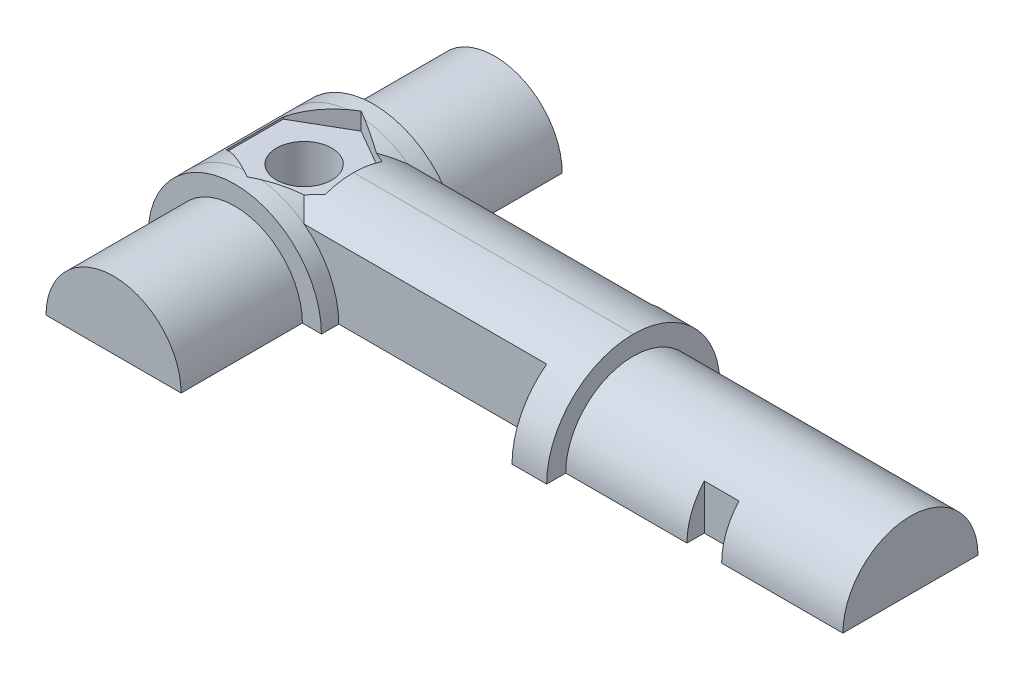
ISO-10303-21;
HEADER;
FILE_DESCRIPTION(('STEP AP214'),'2;1');
FILE_NAME('part.step','',(''),(''),'','','');
FILE_SCHEMA(('AUTOMOTIVE_DESIGN { 1 0 10303 214 1 1 1 1 }'));
ENDSEC;
DATA;
#1=APPLICATION_CONTEXT('core data for automotive mechanical design processes');
#2=APPLICATION_PROTOCOL_DEFINITION('international standard','automotive_design',2000,#1);
#3=PRODUCT_CONTEXT('',#1,'mechanical');
#4=PRODUCT('Part','Part','',(#3));
#5=PRODUCT_RELATED_PRODUCT_CATEGORY('part','',(#4));
#6=PRODUCT_DEFINITION_FORMATION('','',#4);
#7=PRODUCT_DEFINITION_CONTEXT('part definition',#1,'design');
#8=PRODUCT_DEFINITION('design','',#6,#7);
#9=PRODUCT_DEFINITION_SHAPE('','',#8);
#10=(LENGTH_UNIT() NAMED_UNIT(*) SI_UNIT(.MILLI.,.METRE.));
#11=(NAMED_UNIT(*) PLANE_ANGLE_UNIT() SI_UNIT($,.RADIAN.));
#12=(NAMED_UNIT(*) SI_UNIT($,.STERADIAN.) SOLID_ANGLE_UNIT());
#13=UNCERTAINTY_MEASURE_WITH_UNIT(LENGTH_MEASURE(1.E-05),#10,'distance_accuracy_value','');
#14=(GEOMETRIC_REPRESENTATION_CONTEXT(3) GLOBAL_UNCERTAINTY_ASSIGNED_CONTEXT((#13)) GLOBAL_UNIT_ASSIGNED_CONTEXT((#10,
#11,#12)) REPRESENTATION_CONTEXT('',''));
#15=CARTESIAN_POINT('',(0.,0.,0.));
#16=DIRECTION('',(0.,0.,1.));
#17=DIRECTION('',(1.,0.,0.));
#18=AXIS2_PLACEMENT_3D('',#15,#16,#17);
#19=CARTESIAN_POINT('',(0.,0.,4.));
#20=DIRECTION('',(0.,0.,-1.));
#21=DIRECTION('',(-1.,0.,0.));
#22=AXIS2_PLACEMENT_3D('',#19,#20,#21);
#23=CYLINDRICAL_SURFACE('',#22,5.);
#24=CARTESIAN_POINT('',(0.,0.,3.29089653438087));
#25=DIRECTION('',(-0.5,0.,-0.866025403784439));
#26=DIRECTION('',(0.866025403784439,0.,-0.5));
#27=AXIS2_PLACEMENT_3D('',#24,#25,#26);
#28=ELLIPSE('',#27,5.77350269189626,5.);
#29=CARTESIAN_POINT('',(0.,5.,3.29089653438087));
#30=VERTEX_POINT('',#29);
#31=CARTESIAN_POINT('',(0.503847577293437,4.97454898647663,3.));
#32=VERTEX_POINT('',#31);
#33=EDGE_CURVE('E283',#30,#32,#28,.T.);
#34=ORIENTED_EDGE('',*,*,#33,.F.);
#35=CARTESIAN_POINT('',(0.,0.,3.29089653438087));
#36=DIRECTION('',(0.5,0.,-0.866025403784438));
#37=DIRECTION('',(-0.866025403784438,0.,-0.5));
#38=AXIS2_PLACEMENT_3D('',#35,#36,#37);
#39=ELLIPSE('',#38,5.77350269189626,5.);
#40=CARTESIAN_POINT('',(-0.503847577293381,4.97454898647663,3.));
#41=VERTEX_POINT('',#40);
#42=EDGE_CURVE('E288',#41,#30,#39,.T.);
#43=ORIENTED_EDGE('',*,*,#42,.F.);
#44=CARTESIAN_POINT('',(0.,0.,3.));
#45=DIRECTION('',(0.,0.,1.));
#46=DIRECTION('',(-1.,0.,0.));
#47=AXIS2_PLACEMENT_3D('',#44,#45,#46);
#48=CIRCLE('',#47,5.);
#49=CARTESIAN_POINT('',(-5.00000000000006,0.,3.));
#50=VERTEX_POINT('',#49);
#51=EDGE_CURVE('E411',#41,#50,#48,.T.);
#52=ORIENTED_EDGE('',*,*,#51,.T.);
#53=DIRECTION('',(0.,0.,-1.));
#54=VECTOR('',#53,1.);
#55=CARTESIAN_POINT('',(-5.00000000000006,0.,4.));
#56=LINE('',#55,#54);
#57=CARTESIAN_POINT('',(-5.00000000000006,0.,4.));
#58=VERTEX_POINT('',#57);
#59=EDGE_CURVE('E415',#58,#50,#56,.T.);
#60=ORIENTED_EDGE('',*,*,#59,.F.);
#61=CARTESIAN_POINT('',(0.,0.,4.));
#62=DIRECTION('',(0.,0.,1.));
#63=DIRECTION('',(-1.,0.,0.));
#64=AXIS2_PLACEMENT_3D('',#61,#62,#63);
#65=CIRCLE('',#64,5.);
#66=CARTESIAN_POINT('',(5.00000000000006,0.,4.));
#67=VERTEX_POINT('',#66);
#68=EDGE_CURVE('E402',#67,#58,#65,.T.);
#69=ORIENTED_EDGE('',*,*,#68,.F.);
#70=DIRECTION('',(0.,0.,-1.));
#71=VECTOR('',#70,1.);
#72=CARTESIAN_POINT('',(5.00000000000006,0.,4.));
#73=LINE('',#72,#71);
#74=CARTESIAN_POINT('',(5.00000000000006,0.,3.));
#75=VERTEX_POINT('',#74);
#76=EDGE_CURVE('E408',#67,#75,#73,.T.);
#77=ORIENTED_EDGE('',*,*,#76,.T.);
#78=CARTESIAN_POINT('',(3.00000000000006,4.,3.));
#79=VERTEX_POINT('',#78);
#80=EDGE_CURVE('E401',#75,#79,#48,.T.);
#81=ORIENTED_EDGE('',*,*,#80,.T.);
#82=EDGE_CURVE('E412',#79,#32,#48,.T.);
#83=ORIENTED_EDGE('',*,*,#82,.T.);
#84=EDGE_LOOP('',(#34,#43,#52,#60,#69,#77,#81,#83));
#85=FACE_BOUND('',#84,.T.);
#86=ADVANCED_FACE('F38',(#85),#23,.T.);
#87=CARTESIAN_POINT('',(0.,0.,-4.));
#88=DIRECTION('',(0.,0.,1.));
#89=DIRECTION('',(1.,0.,0.));
#90=AXIS2_PLACEMENT_3D('',#87,#88,#89);
#91=CYLINDRICAL_SURFACE('',#90,5.);
#92=CARTESIAN_POINT('',(0.,0.,-3.29089653438087));
#93=DIRECTION('',(0.5,0.,0.866025403784438));
#94=DIRECTION('',(-0.866025403784439,0.,0.5));
#95=AXIS2_PLACEMENT_3D('',#92,#93,#94);
#96=ELLIPSE('',#95,5.77350269189626,5.);
#97=CARTESIAN_POINT('',(-0.503847577293381,4.97454898647663,-3.));
#98=VERTEX_POINT('',#97);
#99=CARTESIAN_POINT('',(0.,5.,-3.29089653438087));
#100=VERTEX_POINT('',#99);
#101=EDGE_CURVE('E285',#98,#100,#96,.F.);
#102=ORIENTED_EDGE('',*,*,#101,.T.);
#103=CARTESIAN_POINT('',(0.,0.,-3.29089653438087));
#104=DIRECTION('',(-0.5,0.,0.866025403784438));
#105=DIRECTION('',(0.866025403784438,0.,0.5));
#106=AXIS2_PLACEMENT_3D('',#103,#104,#105);
#107=ELLIPSE('',#106,5.77350269189626,5.);
#108=CARTESIAN_POINT('',(0.50384757729327,4.97454898647663,-3.));
#109=VERTEX_POINT('',#108);
#110=EDGE_CURVE('E277',#100,#109,#107,.F.);
#111=ORIENTED_EDGE('',*,*,#110,.T.);
#112=CARTESIAN_POINT('',(0.,0.,-3.));
#113=DIRECTION('',(0.,0.,1.));
#114=DIRECTION('',(-1.,0.,0.));
#115=AXIS2_PLACEMENT_3D('',#112,#113,#114);
#116=CIRCLE('',#115,5.);
#117=CARTESIAN_POINT('',(3.00000000000006,4.,-3.));
#118=VERTEX_POINT('',#117);
#119=EDGE_CURVE('E381',#118,#109,#116,.T.);
#120=ORIENTED_EDGE('',*,*,#119,.F.);
#121=CARTESIAN_POINT('',(5.00000000000006,0.,-3.));
#122=VERTEX_POINT('',#121);
#123=EDGE_CURVE('E369',#122,#118,#116,.T.);
#124=ORIENTED_EDGE('',*,*,#123,.F.);
#125=DIRECTION('',(0.,0.,1.));
#126=VECTOR('',#125,1.);
#127=CARTESIAN_POINT('',(5.00000000000006,0.,-4.));
#128=LINE('',#127,#126);
#129=CARTESIAN_POINT('',(5.00000000000006,0.,-4.));
#130=VERTEX_POINT('',#129);
#131=EDGE_CURVE('E384',#130,#122,#128,.T.);
#132=ORIENTED_EDGE('',*,*,#131,.F.);
#133=CARTESIAN_POINT('',(0.,0.,-4.));
#134=DIRECTION('',(0.,0.,1.));
#135=DIRECTION('',(-1.,0.,0.));
#136=AXIS2_PLACEMENT_3D('',#133,#134,#135);
#137=CIRCLE('',#136,5.);
#138=CARTESIAN_POINT('',(-5.00000000000006,0.,-4.));
#139=VERTEX_POINT('',#138);
#140=EDGE_CURVE('E370',#130,#139,#137,.T.);
#141=ORIENTED_EDGE('',*,*,#140,.T.);
#142=DIRECTION('',(0.,0.,1.));
#143=VECTOR('',#142,1.);
#144=CARTESIAN_POINT('',(-5.00000000000006,0.,-4.));
#145=LINE('',#144,#143);
#146=CARTESIAN_POINT('',(-5.00000000000006,0.,-3.));
#147=VERTEX_POINT('',#146);
#148=EDGE_CURVE('E377',#139,#147,#145,.T.);
#149=ORIENTED_EDGE('',*,*,#148,.T.);
#150=EDGE_CURVE('E380',#98,#147,#116,.T.);
#151=ORIENTED_EDGE('',*,*,#150,.F.);
#152=EDGE_LOOP('',(#102,#111,#120,#124,#132,#141,#149,#151));
#153=FACE_BOUND('',#152,.T.);
#154=ADVANCED_FACE('F502',(#153),#91,.T.);
#155=CARTESIAN_POINT('',(0.,0.,0.));
#156=DIRECTION('',(0.,0.,-1.));
#157=DIRECTION('',(-1.,0.,0.));
#158=AXIS2_PLACEMENT_3D('',#155,#156,#157);
#159=CYLINDRICAL_SURFACE('',#158,5.);
#160=ORIENTED_EDGE('',*,*,#119,.T.);
#161=CARTESIAN_POINT('',(0.,0.,-3.29089653438087));
#162=DIRECTION('',(-0.5,0.,0.866025403784438));
#163=DIRECTION('',(-0.866025403784438,0.,-0.5));
#164=AXIS2_PLACEMENT_3D('',#161,#162,#163);
#165=ELLIPSE('',#164,5.77350269189626,5.);
#166=CARTESIAN_POINT('',(2.08634480157127,4.54391520265909,-2.0863448015713));
#167=VERTEX_POINT('',#166);
#168=EDGE_CURVE('E274',#109,#167,#165,.F.);
#169=ORIENTED_EDGE('',*,*,#168,.T.);
#170=CARTESIAN_POINT('',(0.,0.,0.));
#171=DIRECTION('',(0.707106781186547,0.,0.707106781186547));
#172=DIRECTION('',(0.707106781186547,0.,-0.707106781186547));
#173=AXIS2_PLACEMENT_3D('',#170,#171,#172);
#174=ELLIPSE('',#173,7.07106781186547,5.);
#175=EDGE_CURVE('E435',#167,#118,#174,.F.);
#176=ORIENTED_EDGE('',*,*,#175,.T.);
#177=EDGE_LOOP('',(#160,#169,#176));
#178=FACE_BOUND('',#177,.T.);
#179=ADVANCED_FACE('F579',(#178),#159,.T.);
#180=CARTESIAN_POINT('',(0.,0.,0.));
#181=DIRECTION('',(0.707106781186547,0.,-0.707106781186547));
#182=DIRECTION('',(0.707106781186547,0.,0.707106781186547));
#183=AXIS2_PLACEMENT_3D('',#180,#181,#182);
#184=ELLIPSE('',#183,7.07106781186547,5.);
#185=CARTESIAN_POINT('',(2.08634480157133,4.54391520265909,2.0863448015713));
#186=VERTEX_POINT('',#185);
#187=EDGE_CURVE('E437',#79,#186,#184,.F.);
#188=ORIENTED_EDGE('',*,*,#187,.T.);
#189=CARTESIAN_POINT('',(0.,0.,3.29089653438087));
#190=DIRECTION('',(-0.5,0.,-0.866025403784439));
#191=DIRECTION('',(0.866025403784439,0.,-0.5));
#192=AXIS2_PLACEMENT_3D('',#189,#190,#191);
#193=ELLIPSE('',#192,5.77350269189626,5.);
#194=EDGE_CURVE('E280',#186,#32,#193,.F.);
#195=ORIENTED_EDGE('',*,*,#194,.T.);
#196=ORIENTED_EDGE('',*,*,#82,.F.);
#197=EDGE_LOOP('',(#188,#195,#196));
#198=FACE_BOUND('',#197,.T.);
#199=ADVANCED_FACE('F529',(#198),#159,.T.);
#200=ORIENTED_EDGE('',*,*,#51,.F.);
#201=CARTESIAN_POINT('',(0.,0.,3.29089653438087));
#202=DIRECTION('',(0.5,0.,-0.866025403784438));
#203=DIRECTION('',(-0.866025403784438,0.,-0.5));
#204=AXIS2_PLACEMENT_3D('',#201,#202,#203);
#205=ELLIPSE('',#204,5.77350269189626,5.);
#206=CARTESIAN_POINT('',(-2.84999999999996,4.1082234603293,1.64544826719043));
#207=VERTEX_POINT('',#206);
#208=EDGE_CURVE('E11',#41,#207,#205,.F.);
#209=ORIENTED_EDGE('',*,*,#208,.T.);
#210=DIRECTION('',(0.,0.,-1.));
#211=VECTOR('',#210,1.);
#212=CARTESIAN_POINT('',(-2.85000000000002,4.1082234603293,0.));
#213=LINE('',#212,#211);
#214=CARTESIAN_POINT('',(-2.85000000000002,4.10822346032929,-1.64544826719043));
#215=VERTEX_POINT('',#214);
#216=EDGE_CURVE('E46',#207,#215,#213,.T.);
#217=ORIENTED_EDGE('',*,*,#216,.T.);
#218=CARTESIAN_POINT('',(0.,0.,-3.29089653438087));
#219=DIRECTION('',(0.5,0.,0.866025403784438));
#220=DIRECTION('',(0.866025403784439,0.,-0.5));
#221=AXIS2_PLACEMENT_3D('',#218,#219,#220);
#222=ELLIPSE('',#221,5.77350269189626,5.);
#223=EDGE_CURVE('E465',#215,#98,#222,.F.);
#224=ORIENTED_EDGE('',*,*,#223,.T.);
#225=ORIENTED_EDGE('',*,*,#150,.T.);
#226=DIRECTION('',(0.,0.,1.));
#227=VECTOR('',#226,1.);
#228=CARTESIAN_POINT('',(-5.00000000000006,0.,-3.));
#229=LINE('',#228,#227);
#230=EDGE_CURVE('E418',#147,#50,#229,.T.);
#231=ORIENTED_EDGE('',*,*,#230,.T.);
#232=EDGE_LOOP('',(#200,#209,#217,#224,#225,#231));
#233=FACE_BOUND('',#232,.T.);
#234=ADVANCED_FACE('F470',(#233),#159,.T.);
#235=CARTESIAN_POINT('',(19.,0.,0.));
#236=DIRECTION('',(1.,0.,0.));
#237=DIRECTION('',(0.,0.,-1.));
#238=AXIS2_PLACEMENT_3D('',#235,#236,#237);
#239=CYLINDRICAL_SURFACE('',#238,5.);
#240=DIRECTION('',(-1.,0.,0.));
#241=VECTOR('',#240,1.);
#242=CARTESIAN_POINT('',(19.,5.,0.));
#243=LINE('',#242,#241);
#244=CARTESIAN_POINT('',(2.85000000000002,5.,0.));
#245=VERTEX_POINT('',#244);
#246=CARTESIAN_POINT('',(19.,5.,0.));
#247=VERTEX_POINT('',#246);
#248=EDGE_CURVE('E331',#245,#247,#243,.F.);
#249=ORIENTED_EDGE('',*,*,#248,.F.);
#250=CARTESIAN_POINT('',(2.85000000000002,0.,0.));
#251=DIRECTION('',(-1.,0.,0.));
#252=DIRECTION('',(0.,0.,1.));
#253=AXIS2_PLACEMENT_3D('',#250,#251,#252);
#254=CIRCLE('',#253,5.);
#255=CARTESIAN_POINT('',(2.85000000000002,4.72149340781071,1.64544826719043));
#256=VERTEX_POINT('',#255);
#257=EDGE_CURVE('E53',#245,#256,#254,.F.);
#258=ORIENTED_EDGE('',*,*,#257,.T.);
#259=CARTESIAN_POINT('',(5.70000000000004,0.,0.));
#260=DIRECTION('',(-0.5,0.,-0.866025403784439));
#261=DIRECTION('',(0.866025403784439,0.,-0.5));
#262=AXIS2_PLACEMENT_3D('',#259,#260,#261);
#263=ELLIPSE('',#262,10.,5.);
#264=EDGE_CURVE('E462',#256,#186,#263,.F.);
#265=ORIENTED_EDGE('',*,*,#264,.T.);
#266=ORIENTED_EDGE('',*,*,#187,.F.);
#267=DIRECTION('',(1.,0.,0.));
#268=VECTOR('',#267,1.);
#269=CARTESIAN_POINT('',(17.,4.,3.));
#270=LINE('',#269,#268);
#271=CARTESIAN_POINT('',(17.,4.,3.));
#272=VERTEX_POINT('',#271);
#273=EDGE_CURVE('E432',#272,#79,#270,.F.);
#274=ORIENTED_EDGE('',*,*,#273,.F.);
#275=CARTESIAN_POINT('',(17.,0.,0.));
#276=DIRECTION('',(-1.,0.,0.));
#277=DIRECTION('',(0.,0.,1.));
#278=AXIS2_PLACEMENT_3D('',#275,#276,#277);
#279=CIRCLE('',#278,5.);
#280=CARTESIAN_POINT('',(17.,0.,5.));
#281=VERTEX_POINT('',#280);
#282=EDGE_CURVE('E430',#281,#272,#279,.T.);
#283=ORIENTED_EDGE('',*,*,#282,.F.);
#284=DIRECTION('',(-1.,0.,0.));
#285=VECTOR('',#284,1.);
#286=CARTESIAN_POINT('',(19.,0.,5.));
#287=LINE('',#286,#285);
#288=CARTESIAN_POINT('',(19.,0.,5.));
#289=VERTEX_POINT('',#288);
#290=EDGE_CURVE('E343',#289,#281,#287,.T.);
#291=ORIENTED_EDGE('',*,*,#290,.F.);
#292=CARTESIAN_POINT('',(19.,0.,0.));
#293=DIRECTION('',(-1.,0.,0.));
#294=DIRECTION('',(0.,0.,1.));
#295=AXIS2_PLACEMENT_3D('',#292,#293,#294);
#296=CIRCLE('',#295,5.);
#297=EDGE_CURVE('E425',#247,#289,#296,.F.);
#298=ORIENTED_EDGE('',*,*,#297,.F.);
#299=EDGE_LOOP('',(#249,#258,#265,#266,#274,#283,#291,#298));
#300=FACE_BOUND('',#299,.T.);
#301=ADVANCED_FACE('F40',(#300),#239,.T.);
#302=CARTESIAN_POINT('',(0.,0.,0.));
#303=DIRECTION('',(1.,0.,0.));
#304=DIRECTION('',(0.,0.,-1.));
#305=AXIS2_PLACEMENT_3D('',#302,#303,#304);
#306=CYLINDRICAL_SURFACE('',#305,5.);
#307=ORIENTED_EDGE('',*,*,#175,.F.);
#308=CARTESIAN_POINT('',(5.70000000000004,0.,0.));
#309=DIRECTION('',(-0.5,0.,0.866025403784438));
#310=DIRECTION('',(0.866025403784438,0.,0.5));
#311=AXIS2_PLACEMENT_3D('',#308,#309,#310);
#312=ELLIPSE('',#311,9.99999999999999,5.);
#313=CARTESIAN_POINT('',(2.85000000000002,4.72149340781071,-1.64544826719043));
#314=VERTEX_POINT('',#313);
#315=EDGE_CURVE('E460',#167,#314,#312,.F.);
#316=ORIENTED_EDGE('',*,*,#315,.T.);
#317=CARTESIAN_POINT('',(2.85000000000002,0.,0.));
#318=DIRECTION('',(-1.,0.,0.));
#319=DIRECTION('',(0.,0.,1.));
#320=AXIS2_PLACEMENT_3D('',#317,#318,#319);
#321=CIRCLE('',#320,5.);
#322=EDGE_CURVE('E263',#314,#245,#321,.F.);
#323=ORIENTED_EDGE('',*,*,#322,.T.);
#324=ORIENTED_EDGE('',*,*,#248,.T.);
#325=CARTESIAN_POINT('',(19.,0.,0.));
#326=DIRECTION('',(-1.,0.,0.));
#327=DIRECTION('',(0.,0.,1.));
#328=AXIS2_PLACEMENT_3D('',#325,#326,#327);
#329=CIRCLE('',#328,5.);
#330=CARTESIAN_POINT('',(19.,0.,-5.));
#331=VERTEX_POINT('',#330);
#332=EDGE_CURVE('E427',#331,#247,#329,.F.);
#333=ORIENTED_EDGE('',*,*,#332,.F.);
#334=DIRECTION('',(-1.,0.,0.));
#335=VECTOR('',#334,1.);
#336=CARTESIAN_POINT('',(19.,0.,-5.));
#337=LINE('',#336,#335);
#338=CARTESIAN_POINT('',(17.,0.,-5.));
#339=VERTEX_POINT('',#338);
#340=EDGE_CURVE('E335',#331,#339,#337,.T.);
#341=ORIENTED_EDGE('',*,*,#340,.T.);
#342=CARTESIAN_POINT('',(17.,0.,0.));
#343=DIRECTION('',(-1.,0.,0.));
#344=DIRECTION('',(0.,0.,1.));
#345=AXIS2_PLACEMENT_3D('',#342,#343,#344);
#346=CIRCLE('',#345,5.);
#347=CARTESIAN_POINT('',(17.,4.,-3.));
#348=VERTEX_POINT('',#347);
#349=EDGE_CURVE('E423',#348,#339,#346,.T.);
#350=ORIENTED_EDGE('',*,*,#349,.F.);
#351=DIRECTION('',(1.,0.,0.));
#352=VECTOR('',#351,1.);
#353=CARTESIAN_POINT('',(3.00000000000006,4.,-3.));
#354=LINE('',#353,#352);
#355=EDGE_CURVE('E421',#118,#348,#354,.T.);
#356=ORIENTED_EDGE('',*,*,#355,.F.);
#357=EDGE_LOOP('',(#307,#316,#323,#324,#333,#341,#350,#356));
#358=FACE_BOUND('',#357,.T.);
#359=ADVANCED_FACE('F534',(#358),#306,.T.);
#360=CARTESIAN_POINT('',(-5.,5.,-3.));
#361=DIRECTION('',(0.,0.,1.));
#362=DIRECTION('',(1.,0.,0.));
#363=AXIS2_PLACEMENT_3D('',#360,#361,#362);
#364=PLANE('',#363);
#365=ORIENTED_EDGE('',*,*,#123,.T.);
#366=ORIENTED_EDGE('',*,*,#355,.T.);
#367=DIRECTION('',(0.,1.,0.));
#368=VECTOR('',#367,1.);
#369=CARTESIAN_POINT('',(17.,5.,-3.));
#370=LINE('',#369,#368);
#371=CARTESIAN_POINT('',(17.,0.,-3.));
#372=VERTEX_POINT('',#371);
#373=EDGE_CURVE('E345',#372,#348,#370,.T.);
#374=ORIENTED_EDGE('',*,*,#373,.F.);
#375=DIRECTION('',(-1.,0.,0.));
#376=VECTOR('',#375,1.);
#377=CARTESIAN_POINT('',(17.,0.,-3.));
#378=LINE('',#377,#376);
#379=EDGE_CURVE('E350',#372,#122,#378,.T.);
#380=ORIENTED_EDGE('',*,*,#379,.T.);
#381=EDGE_LOOP('',(#365,#366,#374,#380));
#382=FACE_BOUND('',#381,.T.);
#383=ADVANCED_FACE('F551',(#382),#364,.F.);
#384=CARTESIAN_POINT('',(-5.00000000000006,5.,3.));
#385=DIRECTION('',(0.,0.,-1.));
#386=DIRECTION('',(-1.,0.,0.));
#387=AXIS2_PLACEMENT_3D('',#384,#385,#386);
#388=PLANE('',#387);
#389=DIRECTION('',(0.,-1.,0.));
#390=VECTOR('',#389,1.);
#391=CARTESIAN_POINT('',(17.,5.,3.));
#392=LINE('',#391,#390);
#393=CARTESIAN_POINT('',(17.,0.,3.));
#394=VERTEX_POINT('',#393);
#395=EDGE_CURVE('E348',#272,#394,#392,.T.);
#396=ORIENTED_EDGE('',*,*,#395,.F.);
#397=ORIENTED_EDGE('',*,*,#273,.T.);
#398=ORIENTED_EDGE('',*,*,#80,.F.);
#399=DIRECTION('',(-1.,0.,0.));
#400=VECTOR('',#399,1.);
#401=CARTESIAN_POINT('',(17.,0.,3.));
#402=LINE('',#401,#400);
#403=EDGE_CURVE('E353',#394,#75,#402,.T.);
#404=ORIENTED_EDGE('',*,*,#403,.F.);
#405=EDGE_LOOP('',(#396,#397,#398,#404));
#406=FACE_BOUND('',#405,.T.);
#407=ADVANCED_FACE('F522',(#406),#388,.F.);
#408=CARTESIAN_POINT('',(0.,0.,0.));
#409=DIRECTION('',(0.,1.,0.));
#410=DIRECTION('',(0.,0.,1.));
#411=AXIS2_PLACEMENT_3D('',#408,#409,#410);
#412=PLANE('',#411);
#413=CARTESIAN_POINT('',(0.,0.,0.));
#414=DIRECTION('',(0.,-1.,0.));
#415=DIRECTION('',(0.,0.,-1.));
#416=AXIS2_PLACEMENT_3D('',#413,#414,#415);
#417=CIRCLE('',#416,1.6);
#418=CARTESIAN_POINT('',(0.,0.,-1.6));
#419=VERTEX_POINT('',#418);
#420=EDGE_CURVE('E290',#419,#419,#417,.T.);
#421=ORIENTED_EDGE('',*,*,#420,.F.);
#422=EDGE_LOOP('',(#421));
#423=FACE_BOUND('',#422,.T.);
#424=DIRECTION('',(-1.,0.,0.));
#425=VECTOR('',#424,1.);
#426=CARTESIAN_POINT('',(35.,0.,3.9));
#427=LINE('',#426,#425);
#428=CARTESIAN_POINT('',(35.,0.,3.9));
#429=VERTEX_POINT('',#428);
#430=CARTESIAN_POINT('',(28.,0.,3.9));
#431=VERTEX_POINT('',#430);
#432=EDGE_CURVE('E328',#429,#431,#427,.T.);
#433=ORIENTED_EDGE('',*,*,#432,.T.);
#434=DIRECTION('',(0.,0.,1.));
#435=VECTOR('',#434,1.);
#436=CARTESIAN_POINT('',(28.,0.,2.9));
#437=LINE('',#436,#435);
#438=CARTESIAN_POINT('',(28.,0.,2.9));
#439=VERTEX_POINT('',#438);
#440=EDGE_CURVE('E291',#439,#431,#437,.T.);
#441=ORIENTED_EDGE('',*,*,#440,.F.);
#442=DIRECTION('',(1.,0.,0.));
#443=VECTOR('',#442,1.);
#444=CARTESIAN_POINT('',(26.,0.,2.9));
#445=LINE('',#444,#443);
#446=CARTESIAN_POINT('',(26.,0.,2.9));
#447=VERTEX_POINT('',#446);
#448=EDGE_CURVE('E296',#447,#439,#445,.T.);
#449=ORIENTED_EDGE('',*,*,#448,.F.);
#450=DIRECTION('',(0.,0.,-1.));
#451=VECTOR('',#450,1.);
#452=CARTESIAN_POINT('',(26.,0.,2.9));
#453=LINE('',#452,#451);
#454=CARTESIAN_POINT('',(26.,0.,3.9));
#455=VERTEX_POINT('',#454);
#456=EDGE_CURVE('E293',#455,#447,#453,.T.);
#457=ORIENTED_EDGE('',*,*,#456,.F.);
#458=CARTESIAN_POINT('',(19.0000000000001,0.,3.9));
#459=VERTEX_POINT('',#458);
#460=EDGE_CURVE('E327',#455,#459,#427,.T.);
#461=ORIENTED_EDGE('',*,*,#460,.T.);
#462=DIRECTION('',(0.,0.,-1.));
#463=VECTOR('',#462,1.);
#464=CARTESIAN_POINT('',(19.,0.,-5.));
#465=LINE('',#464,#463);
#466=EDGE_CURVE('E332',#289,#459,#465,.T.);
#467=ORIENTED_EDGE('',*,*,#466,.F.);
#468=ORIENTED_EDGE('',*,*,#290,.T.);
#469=DIRECTION('',(0.,0.,-1.));
#470=VECTOR('',#469,1.);
#471=CARTESIAN_POINT('',(17.,0.,-5.));
#472=LINE('',#471,#470);
#473=EDGE_CURVE('E337',#281,#394,#472,.T.);
#474=ORIENTED_EDGE('',*,*,#473,.T.);
#475=ORIENTED_EDGE('',*,*,#403,.T.);
#476=ORIENTED_EDGE('',*,*,#76,.F.);
#477=DIRECTION('',(1.,0.,0.));
#478=VECTOR('',#477,1.);
#479=CARTESIAN_POINT('',(5.00000000000006,0.,4.));
#480=LINE('',#479,#478);
#481=CARTESIAN_POINT('',(3.90000000000001,0.,4.));
#482=VERTEX_POINT('',#481);
#483=EDGE_CURVE('E405',#482,#67,#480,.T.);
#484=ORIENTED_EDGE('',*,*,#483,.F.);
#485=DIRECTION('',(0.,0.,-1.));
#486=VECTOR('',#485,1.);
#487=CARTESIAN_POINT('',(3.90000000000001,0.,11.));
#488=LINE('',#487,#486);
#489=CARTESIAN_POINT('',(3.90000000000001,0.,11.));
#490=VERTEX_POINT('',#489);
#491=EDGE_CURVE('E393',#490,#482,#488,.T.);
#492=ORIENTED_EDGE('',*,*,#491,.F.);
#493=DIRECTION('',(1.,0.,0.));
#494=VECTOR('',#493,1.);
#495=CARTESIAN_POINT('',(-3.89999999999996,0.,11.));
#496=LINE('',#495,#494);
#497=CARTESIAN_POINT('',(-3.89999999999996,0.,11.));
#498=VERTEX_POINT('',#497);
#499=EDGE_CURVE('E391',#498,#490,#496,.T.);
#500=ORIENTED_EDGE('',*,*,#499,.F.);
#501=DIRECTION('',(0.,0.,-1.));
#502=VECTOR('',#501,1.);
#503=CARTESIAN_POINT('',(-3.89999999999996,0.,11.));
#504=LINE('',#503,#502);
#505=CARTESIAN_POINT('',(-3.89999999999996,0.,4.));
#506=VERTEX_POINT('',#505);
#507=EDGE_CURVE('E398',#498,#506,#504,.T.);
#508=ORIENTED_EDGE('',*,*,#507,.T.);
#509=EDGE_CURVE('E406',#58,#506,#480,.T.);
#510=ORIENTED_EDGE('',*,*,#509,.F.);
#511=ORIENTED_EDGE('',*,*,#59,.T.);
#512=ORIENTED_EDGE('',*,*,#230,.F.);
#513=ORIENTED_EDGE('',*,*,#148,.F.);
#514=DIRECTION('',(1.,0.,0.));
#515=VECTOR('',#514,1.);
#516=CARTESIAN_POINT('',(5.00000000000006,0.,-4.));
#517=LINE('',#516,#515);
#518=CARTESIAN_POINT('',(-3.89999999999996,0.,-4.));
#519=VERTEX_POINT('',#518);
#520=EDGE_CURVE('E374',#139,#519,#517,.T.);
#521=ORIENTED_EDGE('',*,*,#520,.T.);
#522=DIRECTION('',(0.,0.,1.));
#523=VECTOR('',#522,1.);
#524=CARTESIAN_POINT('',(-3.90000000000001,0.,-11.));
#525=LINE('',#524,#523);
#526=CARTESIAN_POINT('',(-3.90000000000001,0.,-11.));
#527=VERTEX_POINT('',#526);
#528=EDGE_CURVE('E363',#527,#519,#525,.T.);
#529=ORIENTED_EDGE('',*,*,#528,.F.);
#530=DIRECTION('',(1.,0.,0.));
#531=VECTOR('',#530,1.);
#532=CARTESIAN_POINT('',(-3.90000000000001,0.,-11.));
#533=LINE('',#532,#531);
#534=CARTESIAN_POINT('',(3.90000000000001,0.,-11.));
#535=VERTEX_POINT('',#534);
#536=EDGE_CURVE('E360',#527,#535,#533,.T.);
#537=ORIENTED_EDGE('',*,*,#536,.T.);
#538=DIRECTION('',(0.,0.,1.));
#539=VECTOR('',#538,1.);
#540=CARTESIAN_POINT('',(3.90000000000001,0.,-11.));
#541=LINE('',#540,#539);
#542=CARTESIAN_POINT('',(3.90000000000007,0.,-4.));
#543=VERTEX_POINT('',#542);
#544=EDGE_CURVE('E367',#535,#543,#541,.T.);
#545=ORIENTED_EDGE('',*,*,#544,.T.);
#546=EDGE_CURVE('E373',#543,#130,#517,.T.);
#547=ORIENTED_EDGE('',*,*,#546,.T.);
#548=ORIENTED_EDGE('',*,*,#131,.T.);
#549=ORIENTED_EDGE('',*,*,#379,.F.);
#550=EDGE_CURVE('E340',#372,#339,#472,.T.);
#551=ORIENTED_EDGE('',*,*,#550,.T.);
#552=ORIENTED_EDGE('',*,*,#340,.F.);
#553=CARTESIAN_POINT('',(19.,0.,-3.9));
#554=VERTEX_POINT('',#553);
#555=EDGE_CURVE('E336',#554,#331,#465,.T.);
#556=ORIENTED_EDGE('',*,*,#555,.F.);
#557=DIRECTION('',(-1.,0.,0.));
#558=VECTOR('',#557,1.);
#559=CARTESIAN_POINT('',(35.,0.,-3.9));
#560=LINE('',#559,#558);
#561=CARTESIAN_POINT('',(26.,0.,-3.9));
#562=VERTEX_POINT('',#561);
#563=EDGE_CURVE('E321',#562,#554,#560,.T.);
#564=ORIENTED_EDGE('',*,*,#563,.F.);
#565=DIRECTION('',(0.,0.,-1.));
#566=VECTOR('',#565,1.);
#567=CARTESIAN_POINT('',(26.,0.,-2.9));
#568=LINE('',#567,#566);
#569=CARTESIAN_POINT('',(26.,0.,-2.9));
#570=VERTEX_POINT('',#569);
#571=EDGE_CURVE('E309',#570,#562,#568,.T.);
#572=ORIENTED_EDGE('',*,*,#571,.F.);
#573=DIRECTION('',(-1.,0.,0.));
#574=VECTOR('',#573,1.);
#575=CARTESIAN_POINT('',(26.,0.,-2.9));
#576=LINE('',#575,#574);
#577=CARTESIAN_POINT('',(28.,0.,-2.9));
#578=VERTEX_POINT('',#577);
#579=EDGE_CURVE('E306',#578,#570,#576,.T.);
#580=ORIENTED_EDGE('',*,*,#579,.F.);
#581=DIRECTION('',(0.,0.,1.));
#582=VECTOR('',#581,1.);
#583=CARTESIAN_POINT('',(28.,0.,-2.9));
#584=LINE('',#583,#582);
#585=CARTESIAN_POINT('',(28.,0.,-3.9));
#586=VERTEX_POINT('',#585);
#587=EDGE_CURVE('E303',#586,#578,#584,.T.);
#588=ORIENTED_EDGE('',*,*,#587,.F.);
#589=CARTESIAN_POINT('',(35.,0.,-3.9));
#590=VERTEX_POINT('',#589);
#591=EDGE_CURVE('E324',#590,#586,#560,.T.);
#592=ORIENTED_EDGE('',*,*,#591,.F.);
#593=DIRECTION('',(0.,0.,-1.));
#594=VECTOR('',#593,1.);
#595=CARTESIAN_POINT('',(35.,0.,3.9));
#596=LINE('',#595,#594);
#597=EDGE_CURVE('E319',#429,#590,#596,.T.);
#598=ORIENTED_EDGE('',*,*,#597,.F.);
#599=EDGE_LOOP('',(#433,#441,#449,#457,#461,#467,#468,#474,#475,#476,#484,#492,#500,#508,#510,
#511,#512,#513,#521,#529,#537,#545,#547,#548,#549,#551,#552,#556,#564,#572,#580,#588,#592,#598));
#600=FACE_BOUND('',#599,.T.);
#601=ADVANCED_FACE('F511',(#423,#600),#412,.F.);
#602=CARTESIAN_POINT('',(0.,0.,4.));
#603=DIRECTION('',(0.,0.,-1.));
#604=DIRECTION('',(-1.,0.,0.));
#605=AXIS2_PLACEMENT_3D('',#602,#603,#604);
#606=PLANE('',#605);
#607=CARTESIAN_POINT('',(0.,0.,4.));
#608=DIRECTION('',(0.,0.,1.));
#609=DIRECTION('',(-1.,0.,0.));
#610=AXIS2_PLACEMENT_3D('',#607,#608,#609);
#611=CIRCLE('',#610,3.9);
#612=EDGE_CURVE('E387',#482,#506,#611,.T.);
#613=ORIENTED_EDGE('',*,*,#612,.F.);
#614=ORIENTED_EDGE('',*,*,#483,.T.);
#615=ORIENTED_EDGE('',*,*,#68,.T.);
#616=ORIENTED_EDGE('',*,*,#509,.T.);
#617=EDGE_LOOP('',(#613,#614,#615,#616));
#618=FACE_BOUND('',#617,.T.);
#619=ADVANCED_FACE('F514',(#618),#606,.F.);
#620=CARTESIAN_POINT('',(0.,0.,11.));
#621=DIRECTION('',(0.,0.,-1.));
#622=DIRECTION('',(-1.,0.,0.));
#623=AXIS2_PLACEMENT_3D('',#620,#621,#622);
#624=CYLINDRICAL_SURFACE('',#623,3.9);
#625=ORIENTED_EDGE('',*,*,#612,.T.);
#626=ORIENTED_EDGE('',*,*,#507,.F.);
#627=CARTESIAN_POINT('',(0.,0.,11.));
#628=DIRECTION('',(0.,0.,1.));
#629=DIRECTION('',(-1.,0.,0.));
#630=AXIS2_PLACEMENT_3D('',#627,#628,#629);
#631=CIRCLE('',#630,3.9);
#632=EDGE_CURVE('E388',#490,#498,#631,.T.);
#633=ORIENTED_EDGE('',*,*,#632,.F.);
#634=ORIENTED_EDGE('',*,*,#491,.T.);
#635=EDGE_LOOP('',(#625,#626,#633,#634));
#636=FACE_BOUND('',#635,.T.);
#637=ADVANCED_FACE('F761',(#636),#624,.T.);
#638=CARTESIAN_POINT('',(0.,0.,11.));
#639=DIRECTION('',(0.,0.,-1.));
#640=DIRECTION('',(-1.,0.,0.));
#641=AXIS2_PLACEMENT_3D('',#638,#639,#640);
#642=PLANE('',#641);
#643=ORIENTED_EDGE('',*,*,#632,.T.);
#644=ORIENTED_EDGE('',*,*,#499,.T.);
#645=EDGE_LOOP('',(#643,#644));
#646=FACE_BOUND('',#645,.T.);
#647=ADVANCED_FACE('F769',(#646),#642,.F.);
#648=CARTESIAN_POINT('',(0.,0.,-4.));
#649=DIRECTION('',(0.,0.,1.));
#650=DIRECTION('',(-1.,0.,0.));
#651=AXIS2_PLACEMENT_3D('',#648,#649,#650);
#652=PLANE('',#651);
#653=ORIENTED_EDGE('',*,*,#546,.F.);
#654=CARTESIAN_POINT('',(0.,0.,-4.));
#655=DIRECTION('',(0.,0.,1.));
#656=DIRECTION('',(-1.,0.,0.));
#657=AXIS2_PLACEMENT_3D('',#654,#655,#656);
#658=CIRCLE('',#657,3.9);
#659=EDGE_CURVE('E356',#543,#519,#658,.T.);
#660=ORIENTED_EDGE('',*,*,#659,.T.);
#661=ORIENTED_EDGE('',*,*,#520,.F.);
#662=ORIENTED_EDGE('',*,*,#140,.F.);
#663=EDGE_LOOP('',(#653,#660,#661,#662));
#664=FACE_BOUND('',#663,.T.);
#665=ADVANCED_FACE('F557',(#664),#652,.F.);
#666=CARTESIAN_POINT('',(0.,0.,-11.));
#667=DIRECTION('',(0.,0.,1.));
#668=DIRECTION('',(1.,0.,0.));
#669=AXIS2_PLACEMENT_3D('',#666,#667,#668);
#670=CYLINDRICAL_SURFACE('',#669,3.9);
#671=ORIENTED_EDGE('',*,*,#659,.F.);
#672=ORIENTED_EDGE('',*,*,#544,.F.);
#673=CARTESIAN_POINT('',(0.,0.,-11.));
#674=DIRECTION('',(0.,0.,1.));
#675=DIRECTION('',(-1.,0.,0.));
#676=AXIS2_PLACEMENT_3D('',#673,#674,#675);
#677=CIRCLE('',#676,3.9);
#678=EDGE_CURVE('E357',#535,#527,#677,.T.);
#679=ORIENTED_EDGE('',*,*,#678,.T.);
#680=ORIENTED_EDGE('',*,*,#528,.T.);
#681=EDGE_LOOP('',(#671,#672,#679,#680));
#682=FACE_BOUND('',#681,.T.);
#683=ADVANCED_FACE('F562',(#682),#670,.T.);
#684=CARTESIAN_POINT('',(0.,0.,-11.));
#685=DIRECTION('',(0.,0.,1.));
#686=DIRECTION('',(-1.,0.,0.));
#687=AXIS2_PLACEMENT_3D('',#684,#685,#686);
#688=PLANE('',#687);
#689=ORIENTED_EDGE('',*,*,#678,.F.);
#690=ORIENTED_EDGE('',*,*,#536,.F.);
#691=EDGE_LOOP('',(#689,#690));
#692=FACE_BOUND('',#691,.T.);
#693=ADVANCED_FACE('F564',(#692),#688,.F.);
#694=CARTESIAN_POINT('',(17.,0.,0.));
#695=DIRECTION('',(-1.,0.,0.));
#696=DIRECTION('',(0.,0.,1.));
#697=AXIS2_PLACEMENT_3D('',#694,#695,#696);
#698=PLANE('',#697);
#699=ORIENTED_EDGE('',*,*,#373,.T.);
#700=ORIENTED_EDGE('',*,*,#349,.T.);
#701=ORIENTED_EDGE('',*,*,#550,.F.);
#702=EDGE_LOOP('',(#699,#700,#701));
#703=FACE_BOUND('',#702,.T.);
#704=ADVANCED_FACE('F548',(#703),#698,.T.);
#705=CARTESIAN_POINT('',(19.,0.,0.));
#706=DIRECTION('',(-1.,0.,0.));
#707=DIRECTION('',(0.,0.,1.));
#708=AXIS2_PLACEMENT_3D('',#705,#706,#707);
#709=PLANE('',#708);
#710=CARTESIAN_POINT('',(19.,0.,0.));
#711=DIRECTION('',(1.,0.,0.));
#712=DIRECTION('',(0.,0.,1.));
#713=AXIS2_PLACEMENT_3D('',#710,#711,#712);
#714=CIRCLE('',#713,3.9);
#715=EDGE_CURVE('E301',#554,#459,#714,.T.);
#716=ORIENTED_EDGE('',*,*,#715,.F.);
#717=ORIENTED_EDGE('',*,*,#555,.T.);
#718=ORIENTED_EDGE('',*,*,#332,.T.);
#719=ORIENTED_EDGE('',*,*,#297,.T.);
#720=ORIENTED_EDGE('',*,*,#466,.T.);
#721=EDGE_LOOP('',(#716,#717,#718,#719,#720));
#722=FACE_BOUND('',#721,.T.);
#723=ADVANCED_FACE('F538',(#722),#709,.F.);
#724=ORIENTED_EDGE('',*,*,#473,.F.);
#725=ORIENTED_EDGE('',*,*,#282,.T.);
#726=ORIENTED_EDGE('',*,*,#395,.T.);
#727=EDGE_LOOP('',(#724,#725,#726));
#728=FACE_BOUND('',#727,.T.);
#729=ADVANCED_FACE('F572',(#728),#698,.T.);
#730=CARTESIAN_POINT('',(35.,0.,0.));
#731=DIRECTION('',(-1.,0.,0.));
#732=DIRECTION('',(0.,0.,1.));
#733=AXIS2_PLACEMENT_3D('',#730,#731,#732);
#734=CYLINDRICAL_SURFACE('',#733,3.9);
#735=DIRECTION('',(-1.,0.,0.));
#736=VECTOR('',#735,1.);
#737=CARTESIAN_POINT('',(35.,2.60768096208106,2.9));
#738=LINE('',#737,#736);
#739=CARTESIAN_POINT('',(26.,2.60768096208106,2.9));
#740=VERTEX_POINT('',#739);
#741=CARTESIAN_POINT('',(28.,2.60768096208106,2.9));
#742=VERTEX_POINT('',#741);
#743=EDGE_CURVE('E453',#740,#742,#738,.F.);
#744=ORIENTED_EDGE('',*,*,#743,.T.);
#745=CARTESIAN_POINT('',(28.0000000000001,0.,0.));
#746=DIRECTION('',(1.,0.,0.));
#747=DIRECTION('',(0.,0.,-1.));
#748=AXIS2_PLACEMENT_3D('',#745,#746,#747);
#749=CIRCLE('',#748,3.9);
#750=EDGE_CURVE('E456',#742,#431,#749,.T.);
#751=ORIENTED_EDGE('',*,*,#750,.T.);
#752=ORIENTED_EDGE('',*,*,#432,.F.);
#753=CARTESIAN_POINT('',(35.,0.,0.));
#754=DIRECTION('',(1.,0.,0.));
#755=DIRECTION('',(0.,0.,1.));
#756=AXIS2_PLACEMENT_3D('',#753,#754,#755);
#757=CIRCLE('',#756,3.9);
#758=EDGE_CURVE('E316',#590,#429,#757,.T.);
#759=ORIENTED_EDGE('',*,*,#758,.F.);
#760=ORIENTED_EDGE('',*,*,#591,.T.);
#761=CARTESIAN_POINT('',(28.0000000000001,0.,0.));
#762=DIRECTION('',(1.,0.,0.));
#763=DIRECTION('',(0.,0.,-1.));
#764=AXIS2_PLACEMENT_3D('',#761,#762,#763);
#765=CIRCLE('',#764,3.9);
#766=CARTESIAN_POINT('',(28.,2.60768096208106,-2.9));
#767=VERTEX_POINT('',#766);
#768=EDGE_CURVE('E447',#586,#767,#765,.T.);
#769=ORIENTED_EDGE('',*,*,#768,.T.);
#770=DIRECTION('',(-1.,0.,0.));
#771=VECTOR('',#770,1.);
#772=CARTESIAN_POINT('',(35.,2.60768096208106,-2.9));
#773=LINE('',#772,#771);
#774=CARTESIAN_POINT('',(26.,2.60768096208106,-2.9));
#775=VERTEX_POINT('',#774);
#776=EDGE_CURVE('E440',#767,#775,#773,.T.);
#777=ORIENTED_EDGE('',*,*,#776,.T.);
#778=CARTESIAN_POINT('',(26.0000000000001,0.,0.));
#779=DIRECTION('',(-1.,0.,0.));
#780=DIRECTION('',(0.,0.,1.));
#781=AXIS2_PLACEMENT_3D('',#778,#779,#780);
#782=CIRCLE('',#781,3.9);
#783=EDGE_CURVE('E444',#775,#562,#782,.T.);
#784=ORIENTED_EDGE('',*,*,#783,.T.);
#785=ORIENTED_EDGE('',*,*,#563,.T.);
#786=ORIENTED_EDGE('',*,*,#715,.T.);
#787=ORIENTED_EDGE('',*,*,#460,.F.);
#788=CARTESIAN_POINT('',(26.0000000000001,0.,0.));
#789=DIRECTION('',(-1.,0.,0.));
#790=DIRECTION('',(0.,0.,1.));
#791=AXIS2_PLACEMENT_3D('',#788,#789,#790);
#792=CIRCLE('',#791,3.9);
#793=EDGE_CURVE('E450',#455,#740,#792,.T.);
#794=ORIENTED_EDGE('',*,*,#793,.T.);
#795=EDGE_LOOP('',(#744,#751,#752,#759,#760,#769,#777,#784,#785,#786,#787,#794));
#796=FACE_BOUND('',#795,.T.);
#797=ADVANCED_FACE('F690',(#796),#734,.T.);
#798=CARTESIAN_POINT('',(35.,0.,0.));
#799=DIRECTION('',(-1.,0.,0.));
#800=DIRECTION('',(0.,0.,1.));
#801=AXIS2_PLACEMENT_3D('',#798,#799,#800);
#802=PLANE('',#801);
#803=ORIENTED_EDGE('',*,*,#758,.T.);
#804=ORIENTED_EDGE('',*,*,#597,.T.);
#805=EDGE_LOOP('',(#803,#804));
#806=FACE_BOUND('',#805,.T.);
#807=ADVANCED_FACE('F684',(#806),#802,.F.);
#808=CARTESIAN_POINT('',(28.,5.,-2.9));
#809=DIRECTION('',(1.,0.,0.));
#810=DIRECTION('',(0.,0.,-1.));
#811=AXIS2_PLACEMENT_3D('',#808,#809,#810);
#812=PLANE('',#811);
#813=ORIENTED_EDGE('',*,*,#587,.T.);
#814=DIRECTION('',(0.,-1.,0.));
#815=VECTOR('',#814,1.);
#816=CARTESIAN_POINT('',(28.,5.,-2.9));
#817=LINE('',#816,#815);
#818=EDGE_CURVE('E311',#767,#578,#817,.T.);
#819=ORIENTED_EDGE('',*,*,#818,.F.);
#820=ORIENTED_EDGE('',*,*,#768,.F.);
#821=EDGE_LOOP('',(#813,#819,#820));
#822=FACE_BOUND('',#821,.T.);
#823=ADVANCED_FACE('F677',(#822),#812,.F.);
#824=CARTESIAN_POINT('',(26.,5.,-2.9));
#825=DIRECTION('',(-1.,0.,0.));
#826=DIRECTION('',(0.,0.,1.));
#827=AXIS2_PLACEMENT_3D('',#824,#825,#826);
#828=PLANE('',#827);
#829=DIRECTION('',(0.,-1.,0.));
#830=VECTOR('',#829,1.);
#831=CARTESIAN_POINT('',(26.,5.,-2.9));
#832=LINE('',#831,#830);
#833=EDGE_CURVE('E294',#775,#570,#832,.T.);
#834=ORIENTED_EDGE('',*,*,#833,.T.);
#835=ORIENTED_EDGE('',*,*,#571,.T.);
#836=ORIENTED_EDGE('',*,*,#783,.F.);
#837=EDGE_LOOP('',(#834,#835,#836));
#838=FACE_BOUND('',#837,.T.);
#839=ADVANCED_FACE('F674',(#838),#828,.F.);
#840=CARTESIAN_POINT('',(26.,5.,-2.9));
#841=DIRECTION('',(0.,0.,1.));
#842=DIRECTION('',(1.,0.,0.));
#843=AXIS2_PLACEMENT_3D('',#840,#841,#842);
#844=PLANE('',#843);
#845=ORIENTED_EDGE('',*,*,#818,.T.);
#846=ORIENTED_EDGE('',*,*,#579,.T.);
#847=ORIENTED_EDGE('',*,*,#833,.F.);
#848=ORIENTED_EDGE('',*,*,#776,.F.);
#849=EDGE_LOOP('',(#845,#846,#847,#848));
#850=FACE_BOUND('',#849,.T.);
#851=ADVANCED_FACE('F672',(#850),#844,.F.);
#852=CARTESIAN_POINT('',(28.,5.,2.9));
#853=DIRECTION('',(1.,0.,0.));
#854=DIRECTION('',(0.,0.,-1.));
#855=AXIS2_PLACEMENT_3D('',#852,#853,#854);
#856=PLANE('',#855);
#857=DIRECTION('',(0.,-1.,0.));
#858=VECTOR('',#857,1.);
#859=CARTESIAN_POINT('',(28.,5.,2.9));
#860=LINE('',#859,#858);
#861=EDGE_CURVE('E299',#742,#439,#860,.T.);
#862=ORIENTED_EDGE('',*,*,#861,.T.);
#863=ORIENTED_EDGE('',*,*,#440,.T.);
#864=ORIENTED_EDGE('',*,*,#750,.F.);
#865=EDGE_LOOP('',(#862,#863,#864));
#866=FACE_BOUND('',#865,.T.);
#867=ADVANCED_FACE('F666',(#866),#856,.F.);
#868=CARTESIAN_POINT('',(26.,5.,2.9));
#869=DIRECTION('',(0.,0.,-1.));
#870=DIRECTION('',(-1.,0.,0.));
#871=AXIS2_PLACEMENT_3D('',#868,#869,#870);
#872=PLANE('',#871);
#873=DIRECTION('',(0.,-1.,0.));
#874=VECTOR('',#873,1.);
#875=CARTESIAN_POINT('',(26.,5.,2.9));
#876=LINE('',#875,#874);
#877=EDGE_CURVE('E61',#740,#447,#876,.T.);
#878=ORIENTED_EDGE('',*,*,#877,.T.);
#879=ORIENTED_EDGE('',*,*,#448,.T.);
#880=ORIENTED_EDGE('',*,*,#861,.F.);
#881=ORIENTED_EDGE('',*,*,#743,.F.);
#882=EDGE_LOOP('',(#878,#879,#880,#881));
#883=FACE_BOUND('',#882,.T.);
#884=ADVANCED_FACE('F662',(#883),#872,.F.);
#885=CARTESIAN_POINT('',(26.,5.,2.9));
#886=DIRECTION('',(-1.,0.,0.));
#887=DIRECTION('',(0.,0.,1.));
#888=AXIS2_PLACEMENT_3D('',#885,#886,#887);
#889=PLANE('',#888);
#890=ORIENTED_EDGE('',*,*,#456,.T.);
#891=ORIENTED_EDGE('',*,*,#877,.F.);
#892=ORIENTED_EDGE('',*,*,#793,.F.);
#893=EDGE_LOOP('',(#890,#891,#892));
#894=FACE_BOUND('',#893,.T.);
#895=ADVANCED_FACE('F665',(#894),#889,.F.);
#896=CARTESIAN_POINT('',(0.,5.,0.));
#897=DIRECTION('',(0.,-1.,0.));
#898=DIRECTION('',(0.,0.,-1.));
#899=AXIS2_PLACEMENT_3D('',#896,#897,#898);
#900=CYLINDRICAL_SURFACE('',#899,1.6);
#901=CARTESIAN_POINT('',(0.,4.,0.));
#902=DIRECTION('',(0.,-1.,0.));
#903=DIRECTION('',(0.,0.,-1.));
#904=AXIS2_PLACEMENT_3D('',#901,#902,#903);
#905=CIRCLE('',#904,1.6);
#906=CARTESIAN_POINT('',(0.,4.,-1.6));
#907=VERTEX_POINT('',#906);
#908=EDGE_CURVE('E264',#907,#907,#905,.F.);
#909=ORIENTED_EDGE('',*,*,#908,.T.);
#910=EDGE_LOOP('',(#909));
#911=FACE_BOUND('',#910,.T.);
#912=ORIENTED_EDGE('',*,*,#420,.T.);
#913=EDGE_LOOP('',(#912));
#914=FACE_BOUND('',#913,.T.);
#915=ADVANCED_FACE('F622',(#911,#914),#900,.F.);
#916=CARTESIAN_POINT('',(0.,4.,3.29089653438087));
#917=DIRECTION('',(0.5,0.,-0.866025403784438));
#918=DIRECTION('',(-0.866025403784438,0.,-0.5));
#919=AXIS2_PLACEMENT_3D('',#916,#917,#918);
#920=PLANE('',#919);
#921=ORIENTED_EDGE('',*,*,#42,.T.);
#922=DIRECTION('',(0.,1.,0.));
#923=VECTOR('',#922,1.);
#924=CARTESIAN_POINT('',(0.,4.,3.29089653438087));
#925=LINE('',#924,#923);
#926=CARTESIAN_POINT('',(0.,4.,3.29089653438087));
#927=VERTEX_POINT('',#926);
#928=EDGE_CURVE('E269',#927,#30,#925,.T.);
#929=ORIENTED_EDGE('',*,*,#928,.F.);
#930=DIRECTION('',(-0.866025403784438,0.,-0.5));
#931=VECTOR('',#930,1.);
#932=CARTESIAN_POINT('',(0.,4.,3.29089653438087));
#933=LINE('',#932,#931);
#934=CARTESIAN_POINT('',(-2.85000000000002,4.,1.64544826719043));
#935=VERTEX_POINT('',#934);
#936=EDGE_CURVE('E485',#927,#935,#933,.T.);
#937=ORIENTED_EDGE('',*,*,#936,.T.);
#938=DIRECTION('',(0.,1.,0.));
#939=VECTOR('',#938,1.);
#940=CARTESIAN_POINT('',(-2.85000000000002,4.,1.64544826719043));
#941=LINE('',#940,#939);
#942=EDGE_CURVE('E477',#935,#207,#941,.T.);
#943=ORIENTED_EDGE('',*,*,#942,.T.);
#944=ORIENTED_EDGE('',*,*,#208,.F.);
#945=EDGE_LOOP('',(#921,#929,#937,#943,#944));
#946=FACE_BOUND('',#945,.T.);
#947=ADVANCED_FACE('F482',(#946),#920,.T.);
#948=CARTESIAN_POINT('',(2.85000000000002,4.,1.64544826719043));
#949=DIRECTION('',(-0.5,0.,-0.866025403784439));
#950=DIRECTION('',(-0.866025403784439,0.,0.5));
#951=AXIS2_PLACEMENT_3D('',#948,#949,#950);
#952=PLANE('',#951);
#953=ORIENTED_EDGE('',*,*,#33,.T.);
#954=ORIENTED_EDGE('',*,*,#194,.F.);
#955=ORIENTED_EDGE('',*,*,#264,.F.);
#956=DIRECTION('',(0.,1.,0.));
#957=VECTOR('',#956,1.);
#958=CARTESIAN_POINT('',(2.85000000000002,4.,1.64544826719043));
#959=LINE('',#958,#957);
#960=CARTESIAN_POINT('',(2.85000000000002,4.,1.64544826719043));
#961=VERTEX_POINT('',#960);
#962=EDGE_CURVE('E265',#961,#256,#959,.T.);
#963=ORIENTED_EDGE('',*,*,#962,.F.);
#964=DIRECTION('',(-0.866025403784439,0.,0.5));
#965=VECTOR('',#964,1.);
#966=CARTESIAN_POINT('',(2.85000000000002,4.,1.64544826719043));
#967=LINE('',#966,#965);
#968=EDGE_CURVE('E249',#961,#927,#967,.T.);
#969=ORIENTED_EDGE('',*,*,#968,.T.);
#970=ORIENTED_EDGE('',*,*,#928,.T.);
#971=EDGE_LOOP('',(#953,#954,#955,#963,#969,#970));
#972=FACE_BOUND('',#971,.T.);
#973=ADVANCED_FACE('F497',(#972),#952,.T.);
#974=CARTESIAN_POINT('',(0.,4.,0.));
#975=DIRECTION('',(0.,-1.,0.));
#976=DIRECTION('',(0.,0.,-1.));
#977=AXIS2_PLACEMENT_3D('',#974,#975,#976);
#978=PLANE('',#977);
#979=DIRECTION('',(0.866025403784438,0.,0.5));
#980=VECTOR('',#979,1.);
#981=CARTESIAN_POINT('',(0.,4.,-3.29089653438087));
#982=LINE('',#981,#980);
#983=CARTESIAN_POINT('',(0.,4.,-3.29089653438087));
#984=VERTEX_POINT('',#983);
#985=CARTESIAN_POINT('',(2.85000000000002,4.,-1.64544826719043));
#986=VERTEX_POINT('',#985);
#987=EDGE_CURVE('E247',#984,#986,#982,.T.);
#988=ORIENTED_EDGE('',*,*,#987,.F.);
#989=DIRECTION('',(0.866025403784439,0.,-0.5));
#990=VECTOR('',#989,1.);
#991=CARTESIAN_POINT('',(-2.85000000000002,4.,-1.64544826719043));
#992=LINE('',#991,#990);
#993=CARTESIAN_POINT('',(-2.85000000000002,4.,-1.64544826719043));
#994=VERTEX_POINT('',#993);
#995=EDGE_CURVE('E491',#994,#984,#992,.T.);
#996=ORIENTED_EDGE('',*,*,#995,.F.);
#997=DIRECTION('',(0.,0.,-1.));
#998=VECTOR('',#997,1.);
#999=CARTESIAN_POINT('',(-2.85000000000002,4.,1.64544826719043));
#1000=LINE('',#999,#998);
#1001=EDGE_CURVE('E493',#935,#994,#1000,.T.);
#1002=ORIENTED_EDGE('',*,*,#1001,.F.);
#1003=ORIENTED_EDGE('',*,*,#936,.F.);
#1004=ORIENTED_EDGE('',*,*,#968,.F.);
#1005=DIRECTION('',(0.,0.,1.));
#1006=VECTOR('',#1005,1.);
#1007=CARTESIAN_POINT('',(2.85000000000002,4.,-1.64544826719043));
#1008=LINE('',#1007,#1006);
#1009=EDGE_CURVE('E242',#986,#961,#1008,.T.);
#1010=ORIENTED_EDGE('',*,*,#1009,.F.);
#1011=EDGE_LOOP('',(#988,#996,#1002,#1003,#1004,#1010));
#1012=FACE_BOUND('',#1011,.T.);
#1013=ORIENTED_EDGE('',*,*,#908,.F.);
#1014=EDGE_LOOP('',(#1013));
#1015=FACE_BOUND('',#1014,.T.);
#1016=ADVANCED_FACE('F244',(#1012,#1015),#978,.F.);
#1017=CARTESIAN_POINT('',(0.,4.,-3.29089653438087));
#1018=DIRECTION('',(-0.5,0.,0.866025403784438));
#1019=DIRECTION('',(0.866025403784438,0.,0.5));
#1020=AXIS2_PLACEMENT_3D('',#1017,#1018,#1019);
#1021=PLANE('',#1020);
#1022=DIRECTION('',(0.,1.,0.));
#1023=VECTOR('',#1022,1.);
#1024=CARTESIAN_POINT('',(0.,4.,-3.29089653438087));
#1025=LINE('',#1024,#1023);
#1026=EDGE_CURVE('E260',#984,#100,#1025,.T.);
#1027=ORIENTED_EDGE('',*,*,#1026,.F.);
#1028=ORIENTED_EDGE('',*,*,#987,.T.);
#1029=DIRECTION('',(0.,1.,0.));
#1030=VECTOR('',#1029,1.);
#1031=CARTESIAN_POINT('',(2.85000000000002,4.,-1.64544826719043));
#1032=LINE('',#1031,#1030);
#1033=EDGE_CURVE('E257',#986,#314,#1032,.T.);
#1034=ORIENTED_EDGE('',*,*,#1033,.T.);
#1035=ORIENTED_EDGE('',*,*,#315,.F.);
#1036=ORIENTED_EDGE('',*,*,#168,.F.);
#1037=ORIENTED_EDGE('',*,*,#110,.F.);
#1038=EDGE_LOOP('',(#1027,#1028,#1034,#1035,#1036,#1037));
#1039=FACE_BOUND('',#1038,.T.);
#1040=ADVANCED_FACE('F256',(#1039),#1021,.T.);
#1041=CARTESIAN_POINT('',(2.85000000000002,4.,-1.64544826719043));
#1042=DIRECTION('',(-1.,0.,0.));
#1043=DIRECTION('',(0.,0.,1.));
#1044=AXIS2_PLACEMENT_3D('',#1041,#1042,#1043);
#1045=PLANE('',#1044);
#1046=ORIENTED_EDGE('',*,*,#322,.F.);
#1047=ORIENTED_EDGE('',*,*,#1033,.F.);
#1048=ORIENTED_EDGE('',*,*,#1009,.T.);
#1049=ORIENTED_EDGE('',*,*,#962,.T.);
#1050=ORIENTED_EDGE('',*,*,#257,.F.);
#1051=EDGE_LOOP('',(#1046,#1047,#1048,#1049,#1050));
#1052=FACE_BOUND('',#1051,.T.);
#1053=ADVANCED_FACE('F262',(#1052),#1045,.T.);
#1054=CARTESIAN_POINT('',(-2.85000000000002,4.,1.64544826719043));
#1055=DIRECTION('',(1.,0.,0.));
#1056=DIRECTION('',(0.,0.,-1.));
#1057=AXIS2_PLACEMENT_3D('',#1054,#1055,#1056);
#1058=PLANE('',#1057);
#1059=ORIENTED_EDGE('',*,*,#942,.F.);
#1060=ORIENTED_EDGE('',*,*,#1001,.T.);
#1061=DIRECTION('',(0.,1.,0.));
#1062=VECTOR('',#1061,1.);
#1063=CARTESIAN_POINT('',(-2.85000000000002,4.,-1.64544826719043));
#1064=LINE('',#1063,#1062);
#1065=EDGE_CURVE('E480',#994,#215,#1064,.T.);
#1066=ORIENTED_EDGE('',*,*,#1065,.T.);
#1067=ORIENTED_EDGE('',*,*,#216,.F.);
#1068=EDGE_LOOP('',(#1059,#1060,#1066,#1067));
#1069=FACE_BOUND('',#1068,.T.);
#1070=ADVANCED_FACE('F476',(#1069),#1058,.T.);
#1071=CARTESIAN_POINT('',(-2.85000000000002,4.,-1.64544826719043));
#1072=DIRECTION('',(0.5,0.,0.866025403784438));
#1073=DIRECTION('',(0.866025403784439,0.,-0.5));
#1074=AXIS2_PLACEMENT_3D('',#1071,#1072,#1073);
#1075=PLANE('',#1074);
#1076=ORIENTED_EDGE('',*,*,#223,.F.);
#1077=ORIENTED_EDGE('',*,*,#1065,.F.);
#1078=ORIENTED_EDGE('',*,*,#995,.T.);
#1079=ORIENTED_EDGE('',*,*,#1026,.T.);
#1080=ORIENTED_EDGE('',*,*,#101,.F.);
#1081=EDGE_LOOP('',(#1076,#1077,#1078,#1079,#1080));
#1082=FACE_BOUND('',#1081,.T.);
#1083=ADVANCED_FACE('F500',(#1082),#1075,.T.);
#1084=CLOSED_SHELL('',(#86,#154,#179,#199,#234,#301,#359,#383,#407,#601,#619,#637,#647,#665,
#683,#693,#704,#723,#729,#797,#807,#823,#839,#851,#867,#884,#895,#915,#947,#973,#1016,#1040,
#1053,#1070,#1083));
#1085=MANIFOLD_SOLID_BREP('B2',#1084);
#1086=ADVANCED_BREP_SHAPE_REPRESENTATION('',(#18,#1085),#14);
#1087=SHAPE_DEFINITION_REPRESENTATION(#9,#1086);
ENDSEC;
END-ISO-10303-21;
